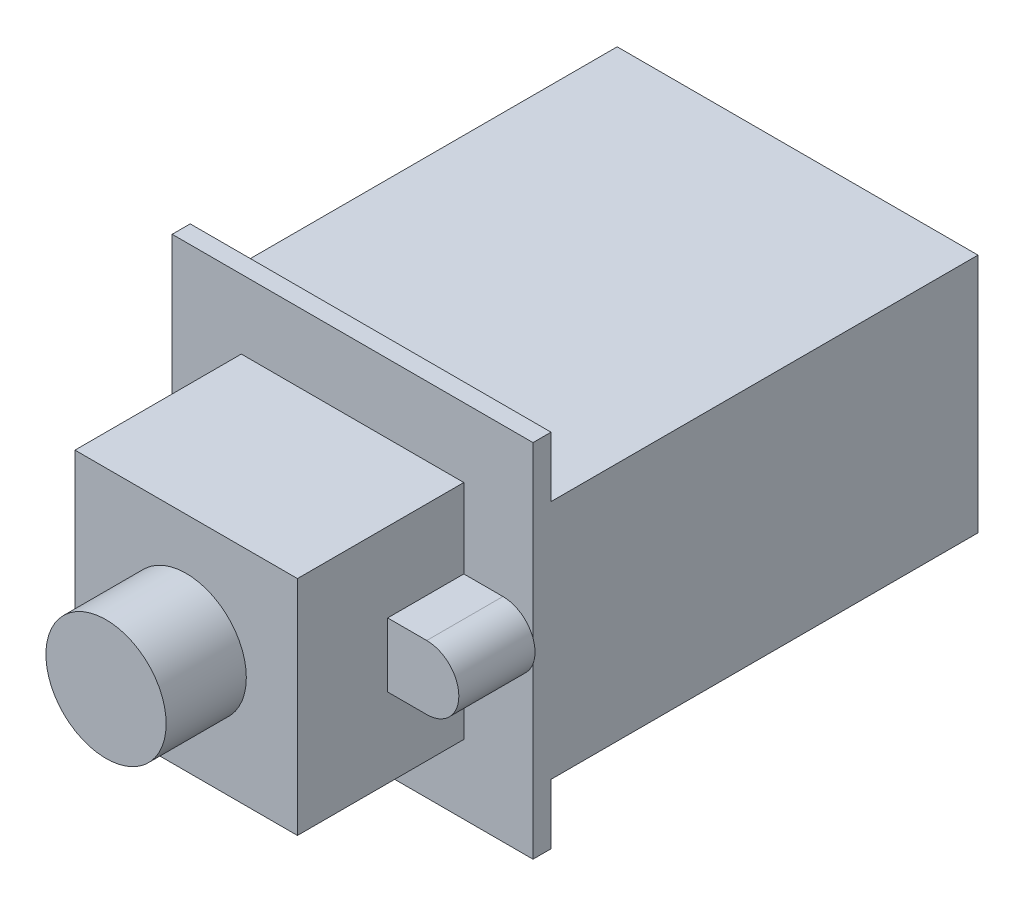
ISO-10303-21;
HEADER;
FILE_DESCRIPTION(('STEP AP214'),'2;1');
FILE_NAME('part.step','',(''),(''),'','','');
FILE_SCHEMA(('AUTOMOTIVE_DESIGN { 1 0 10303 214 1 1 1 1 }'));
ENDSEC;
DATA;
#1=APPLICATION_CONTEXT('core data for automotive mechanical design processes');
#2=APPLICATION_PROTOCOL_DEFINITION('international standard','automotive_design',2000,#1);
#3=PRODUCT_CONTEXT('',#1,'mechanical');
#4=PRODUCT('Part','Part','',(#3));
#5=PRODUCT_RELATED_PRODUCT_CATEGORY('part','',(#4));
#6=PRODUCT_DEFINITION_FORMATION('','',#4);
#7=PRODUCT_DEFINITION_CONTEXT('part definition',#1,'design');
#8=PRODUCT_DEFINITION('design','',#6,#7);
#9=PRODUCT_DEFINITION_SHAPE('','',#8);
#10=(LENGTH_UNIT() NAMED_UNIT(*) SI_UNIT(.MILLI.,.METRE.));
#11=(NAMED_UNIT(*) PLANE_ANGLE_UNIT() SI_UNIT($,.RADIAN.));
#12=(NAMED_UNIT(*) SI_UNIT($,.STERADIAN.) SOLID_ANGLE_UNIT());
#13=UNCERTAINTY_MEASURE_WITH_UNIT(LENGTH_MEASURE(1.E-05),#10,'distance_accuracy_value','');
#14=(GEOMETRIC_REPRESENTATION_CONTEXT(3) GLOBAL_UNCERTAINTY_ASSIGNED_CONTEXT((#13)) GLOBAL_UNIT_ASSIGNED_CONTEXT((#10,
#11,#12)) REPRESENTATION_CONTEXT('',''));
#15=CARTESIAN_POINT('',(0.,0.,0.));
#16=DIRECTION('',(0.,0.,1.));
#17=DIRECTION('',(1.,0.,0.));
#18=AXIS2_PLACEMENT_3D('',#15,#16,#17);
#19=CARTESIAN_POINT('',(0.,0.,-1.143));
#20=DIRECTION('',(0.,0.,1.));
#21=DIRECTION('',(1.,0.,0.));
#22=AXIS2_PLACEMENT_3D('',#19,#20,#21);
#23=PLANE('',#22);
#24=DIRECTION('',(-1.,0.,0.));
#25=VECTOR('',#24,1.);
#26=CARTESIAN_POINT('',(11.43,-7.62,-1.143));
#27=LINE('',#26,#25);
#28=CARTESIAN_POINT('',(11.43,-7.62,-1.143));
#29=VERTEX_POINT('',#28);
#30=CARTESIAN_POINT('',(-11.43,-7.62,-1.143));
#31=VERTEX_POINT('',#30);
#32=EDGE_CURVE('E54',#29,#31,#27,.T.);
#33=ORIENTED_EDGE('',*,*,#32,.F.);
#34=DIRECTION('',(0.,-1.,0.));
#35=VECTOR('',#34,1.);
#36=CARTESIAN_POINT('',(11.43,-11.43,-1.143));
#37=LINE('',#36,#35);
#38=CARTESIAN_POINT('',(11.43,-11.43,-1.143));
#39=VERTEX_POINT('',#38);
#40=EDGE_CURVE('E221',#29,#39,#37,.T.);
#41=ORIENTED_EDGE('',*,*,#40,.T.);
#42=DIRECTION('',(-1.,0.,0.));
#43=VECTOR('',#42,1.);
#44=CARTESIAN_POINT('',(11.43,-11.43,-1.143));
#45=LINE('',#44,#43);
#46=CARTESIAN_POINT('',(-11.43,-11.43,-1.143));
#47=VERTEX_POINT('',#46);
#48=EDGE_CURVE('E224',#39,#47,#45,.T.);
#49=ORIENTED_EDGE('',*,*,#48,.T.);
#50=DIRECTION('',(0.,1.,0.));
#51=VECTOR('',#50,1.);
#52=CARTESIAN_POINT('',(-11.43,-11.43,-1.143));
#53=LINE('',#52,#51);
#54=EDGE_CURVE('E217',#47,#31,#53,.T.);
#55=ORIENTED_EDGE('',*,*,#54,.T.);
#56=EDGE_LOOP('',(#33,#41,#49,#55));
#57=FACE_BOUND('',#56,.T.);
#58=ADVANCED_FACE('F35',(#57),#23,.F.);
#59=DIRECTION('',(1.,0.,0.));
#60=VECTOR('',#59,1.);
#61=CARTESIAN_POINT('',(11.43,7.62,-1.143));
#62=LINE('',#61,#60);
#63=CARTESIAN_POINT('',(-11.43,7.62,-1.143));
#64=VERTEX_POINT('',#63);
#65=CARTESIAN_POINT('',(11.43,7.62,-1.143));
#66=VERTEX_POINT('',#65);
#67=EDGE_CURVE('E62',#64,#66,#62,.T.);
#68=ORIENTED_EDGE('',*,*,#67,.F.);
#69=CARTESIAN_POINT('',(-11.43,11.43,-1.143));
#70=VERTEX_POINT('',#69);
#71=EDGE_CURVE('E211',#64,#70,#53,.T.);
#72=ORIENTED_EDGE('',*,*,#71,.T.);
#73=DIRECTION('',(1.,0.,0.));
#74=VECTOR('',#73,1.);
#75=CARTESIAN_POINT('',(11.43,11.43,-1.143));
#76=LINE('',#75,#74);
#77=CARTESIAN_POINT('',(11.43,11.43,-1.143));
#78=VERTEX_POINT('',#77);
#79=EDGE_CURVE('E219',#70,#78,#76,.T.);
#80=ORIENTED_EDGE('',*,*,#79,.T.);
#81=EDGE_CURVE('E222',#78,#66,#37,.T.);
#82=ORIENTED_EDGE('',*,*,#81,.T.);
#83=EDGE_LOOP('',(#68,#72,#80,#82));
#84=FACE_BOUND('',#83,.T.);
#85=ADVANCED_FACE('F402',(#84),#23,.F.);
#86=CARTESIAN_POINT('',(0.,0.,0.));
#87=DIRECTION('',(0.,0.,-1.));
#88=DIRECTION('',(-1.,0.,0.));
#89=AXIS2_PLACEMENT_3D('',#86,#87,#88);
#90=PLANE('',#89);
#91=DIRECTION('',(0.,1.,0.));
#92=VECTOR('',#91,1.);
#93=CARTESIAN_POINT('',(-11.43,-11.43,0.));
#94=LINE('',#93,#92);
#95=CARTESIAN_POINT('',(-11.43,-0.707106074079417,0.));
#96=VERTEX_POINT('',#95);
#97=CARTESIAN_POINT('',(-11.43,0.707106074079415,0.));
#98=VERTEX_POINT('',#97);
#99=EDGE_CURVE('E11',#96,#98,#94,.T.);
#100=ORIENTED_EDGE('',*,*,#99,.F.);
#101=CARTESIAN_POINT('',(-9.525,0.,0.));
#102=DIRECTION('',(0.,0.,1.));
#103=DIRECTION('',(1.,0.,0.));
#104=AXIS2_PLACEMENT_3D('',#101,#102,#103);
#105=CIRCLE('',#104,2.032);
#106=EDGE_CURVE('E262',#98,#96,#105,.T.);
#107=ORIENTED_EDGE('',*,*,#106,.F.);
#108=EDGE_LOOP('',(#100,#107));
#109=FACE_BOUND('',#108,.T.);
#110=ADVANCED_FACE('F397',(#109),#90,.T.);
#111=CARTESIAN_POINT('',(-7.0485,-7.0485,10.541));
#112=DIRECTION('',(1.,0.,0.));
#113=DIRECTION('',(0.,0.,-1.));
#114=AXIS2_PLACEMENT_3D('',#111,#112,#113);
#115=PLANE('',#114);
#116=DIRECTION('',(0.,0.,-1.));
#117=VECTOR('',#116,1.);
#118=CARTESIAN_POINT('',(-7.0485,2.032,4.826));
#119=LINE('',#118,#117);
#120=CARTESIAN_POINT('',(-7.0485,2.032,4.826));
#121=VERTEX_POINT('',#120);
#122=CARTESIAN_POINT('',(-7.0485,2.032,0.));
#123=VERTEX_POINT('',#122);
#124=EDGE_CURVE('E272',#121,#123,#119,.T.);
#125=ORIENTED_EDGE('',*,*,#124,.F.);
#126=DIRECTION('',(0.,1.,0.));
#127=VECTOR('',#126,1.);
#128=CARTESIAN_POINT('',(-7.0485,2.032,4.826));
#129=LINE('',#128,#127);
#130=CARTESIAN_POINT('',(-7.0485,-2.032,4.826));
#131=VERTEX_POINT('',#130);
#132=EDGE_CURVE('E253',#131,#121,#129,.T.);
#133=ORIENTED_EDGE('',*,*,#132,.F.);
#134=DIRECTION('',(0.,0.,-1.));
#135=VECTOR('',#134,1.);
#136=CARTESIAN_POINT('',(-7.0485,-2.032,4.826));
#137=LINE('',#136,#135);
#138=CARTESIAN_POINT('',(-7.0485,-2.032,0.));
#139=VERTEX_POINT('',#138);
#140=EDGE_CURVE('E269',#131,#139,#137,.T.);
#141=ORIENTED_EDGE('',*,*,#140,.T.);
#142=DIRECTION('',(0.,-1.,0.));
#143=VECTOR('',#142,1.);
#144=CARTESIAN_POINT('',(-7.0485,-7.0485,0.));
#145=LINE('',#144,#143);
#146=CARTESIAN_POINT('',(-7.0485,-7.0485,0.));
#147=VERTEX_POINT('',#146);
#148=EDGE_CURVE('E330',#139,#147,#145,.T.);
#149=ORIENTED_EDGE('',*,*,#148,.T.);
#150=DIRECTION('',(0.,0.,-1.));
#151=VECTOR('',#150,1.);
#152=CARTESIAN_POINT('',(-7.0485,-7.0485,10.541));
#153=LINE('',#152,#151);
#154=CARTESIAN_POINT('',(-7.0485,-7.0485,10.541));
#155=VERTEX_POINT('',#154);
#156=EDGE_CURVE('E337',#155,#147,#153,.T.);
#157=ORIENTED_EDGE('',*,*,#156,.F.);
#158=DIRECTION('',(0.,-1.,0.));
#159=VECTOR('',#158,1.);
#160=CARTESIAN_POINT('',(-7.0485,-7.0485,10.541));
#161=LINE('',#160,#159);
#162=CARTESIAN_POINT('',(-7.0485,7.0485,10.541));
#163=VERTEX_POINT('',#162);
#164=EDGE_CURVE('E320',#163,#155,#161,.T.);
#165=ORIENTED_EDGE('',*,*,#164,.F.);
#166=DIRECTION('',(0.,0.,-1.));
#167=VECTOR('',#166,1.);
#168=CARTESIAN_POINT('',(-7.0485,7.0485,10.541));
#169=LINE('',#168,#167);
#170=CARTESIAN_POINT('',(-7.0485,7.0485,0.));
#171=VERTEX_POINT('',#170);
#172=EDGE_CURVE('E339',#163,#171,#169,.T.);
#173=ORIENTED_EDGE('',*,*,#172,.T.);
#174=EDGE_CURVE('E331',#171,#123,#145,.T.);
#175=ORIENTED_EDGE('',*,*,#174,.T.);
#176=EDGE_LOOP('',(#125,#133,#141,#149,#157,#165,#173,#175));
#177=FACE_BOUND('',#176,.T.);
#178=ADVANCED_FACE('F358',(#177),#115,.F.);
#179=CARTESIAN_POINT('',(7.0485,-7.0485,10.541));
#180=DIRECTION('',(-1.,0.,0.));
#181=DIRECTION('',(0.,0.,1.));
#182=AXIS2_PLACEMENT_3D('',#179,#180,#181);
#183=PLANE('',#182);
#184=DIRECTION('',(0.,0.,-1.));
#185=VECTOR('',#184,1.);
#186=CARTESIAN_POINT('',(7.0485,-2.032,4.826));
#187=LINE('',#186,#185);
#188=CARTESIAN_POINT('',(7.0485,-2.032,4.826));
#189=VERTEX_POINT('',#188);
#190=CARTESIAN_POINT('',(7.0485,-2.032,0.));
#191=VERTEX_POINT('',#190);
#192=EDGE_CURVE('E305',#189,#191,#187,.T.);
#193=ORIENTED_EDGE('',*,*,#192,.F.);
#194=DIRECTION('',(0.,1.,0.));
#195=VECTOR('',#194,1.);
#196=CARTESIAN_POINT('',(7.0485,2.032,4.826));
#197=LINE('',#196,#195);
#198=CARTESIAN_POINT('',(7.0485,2.032,4.826));
#199=VERTEX_POINT('',#198);
#200=EDGE_CURVE('E283',#189,#199,#197,.T.);
#201=ORIENTED_EDGE('',*,*,#200,.T.);
#202=DIRECTION('',(0.,0.,-1.));
#203=VECTOR('',#202,1.);
#204=CARTESIAN_POINT('',(7.0485,2.032,4.826));
#205=LINE('',#204,#203);
#206=CARTESIAN_POINT('',(7.0485,2.032,0.));
#207=VERTEX_POINT('',#206);
#208=EDGE_CURVE('E302',#199,#207,#205,.T.);
#209=ORIENTED_EDGE('',*,*,#208,.T.);
#210=DIRECTION('',(0.,1.,0.));
#211=VECTOR('',#210,1.);
#212=CARTESIAN_POINT('',(7.0485,-7.0485,0.));
#213=LINE('',#212,#211);
#214=CARTESIAN_POINT('',(7.0485,7.0485,0.));
#215=VERTEX_POINT('',#214);
#216=EDGE_CURVE('E310',#207,#215,#213,.T.);
#217=ORIENTED_EDGE('',*,*,#216,.T.);
#218=DIRECTION('',(0.,0.,-1.));
#219=VECTOR('',#218,1.);
#220=CARTESIAN_POINT('',(7.0485,7.0485,10.541));
#221=LINE('',#220,#219);
#222=CARTESIAN_POINT('',(7.0485,7.0485,10.541));
#223=VERTEX_POINT('',#222);
#224=EDGE_CURVE('E39',#223,#215,#221,.T.);
#225=ORIENTED_EDGE('',*,*,#224,.F.);
#226=DIRECTION('',(0.,1.,0.));
#227=VECTOR('',#226,1.);
#228=CARTESIAN_POINT('',(7.0485,-7.0485,10.541));
#229=LINE('',#228,#227);
#230=CARTESIAN_POINT('',(7.0485,-7.0485,10.541));
#231=VERTEX_POINT('',#230);
#232=EDGE_CURVE('E314',#231,#223,#229,.T.);
#233=ORIENTED_EDGE('',*,*,#232,.F.);
#234=DIRECTION('',(0.,0.,-1.));
#235=VECTOR('',#234,1.);
#236=CARTESIAN_POINT('',(7.0485,-7.0485,10.541));
#237=LINE('',#236,#235);
#238=CARTESIAN_POINT('',(7.0485,-7.0485,0.));
#239=VERTEX_POINT('',#238);
#240=EDGE_CURVE('E324',#231,#239,#237,.T.);
#241=ORIENTED_EDGE('',*,*,#240,.T.);
#242=EDGE_CURVE('E325',#239,#191,#213,.T.);
#243=ORIENTED_EDGE('',*,*,#242,.T.);
#244=EDGE_LOOP('',(#193,#201,#209,#217,#225,#233,#241,#243));
#245=FACE_BOUND('',#244,.T.);
#246=ADVANCED_FACE('F37',(#245),#183,.F.);
#247=CARTESIAN_POINT('',(-7.0485,7.0485,10.541));
#248=DIRECTION('',(0.,-1.,0.));
#249=DIRECTION('',(0.,0.,-1.));
#250=AXIS2_PLACEMENT_3D('',#247,#248,#249);
#251=PLANE('',#250);
#252=DIRECTION('',(-1.,0.,0.));
#253=VECTOR('',#252,1.);
#254=CARTESIAN_POINT('',(-7.0485,7.0485,0.));
#255=LINE('',#254,#253);
#256=EDGE_CURVE('E328',#215,#171,#255,.T.);
#257=ORIENTED_EDGE('',*,*,#256,.T.);
#258=ORIENTED_EDGE('',*,*,#172,.F.);
#259=DIRECTION('',(-1.,0.,0.));
#260=VECTOR('',#259,1.);
#261=CARTESIAN_POINT('',(-7.0485,7.0485,10.541));
#262=LINE('',#261,#260);
#263=EDGE_CURVE('E317',#223,#163,#262,.T.);
#264=ORIENTED_EDGE('',*,*,#263,.F.);
#265=ORIENTED_EDGE('',*,*,#224,.T.);
#266=EDGE_LOOP('',(#257,#258,#264,#265));
#267=FACE_BOUND('',#266,.T.);
#268=ADVANCED_FACE('F349',(#267),#251,.F.);
#269=CARTESIAN_POINT('',(-7.0485,-7.0485,10.541));
#270=DIRECTION('',(0.,1.,0.));
#271=DIRECTION('',(0.,0.,1.));
#272=AXIS2_PLACEMENT_3D('',#269,#270,#271);
#273=PLANE('',#272);
#274=DIRECTION('',(1.,0.,0.));
#275=VECTOR('',#274,1.);
#276=CARTESIAN_POINT('',(-7.0485,-7.0485,0.));
#277=LINE('',#276,#275);
#278=EDGE_CURVE('E318',#147,#239,#277,.T.);
#279=ORIENTED_EDGE('',*,*,#278,.T.);
#280=ORIENTED_EDGE('',*,*,#240,.F.);
#281=DIRECTION('',(1.,0.,0.));
#282=VECTOR('',#281,1.);
#283=CARTESIAN_POINT('',(-7.0485,-7.0485,10.541));
#284=LINE('',#283,#282);
#285=EDGE_CURVE('E322',#155,#231,#284,.T.);
#286=ORIENTED_EDGE('',*,*,#285,.F.);
#287=ORIENTED_EDGE('',*,*,#156,.T.);
#288=EDGE_LOOP('',(#279,#280,#286,#287));
#289=FACE_BOUND('',#288,.T.);
#290=ADVANCED_FACE('F381',(#289),#273,.F.);
#291=CARTESIAN_POINT('',(0.,0.,10.541));
#292=DIRECTION('',(0.,0.,-1.));
#293=DIRECTION('',(-1.,0.,0.));
#294=AXIS2_PLACEMENT_3D('',#291,#292,#293);
#295=PLANE('',#294);
#296=CARTESIAN_POINT('',(0.,0.,10.541));
#297=DIRECTION('',(0.,0.,1.));
#298=DIRECTION('',(1.,0.,0.));
#299=AXIS2_PLACEMENT_3D('',#296,#297,#298);
#300=CIRCLE('',#299,3.81);
#301=CARTESIAN_POINT('',(3.81,0.,10.541));
#302=VERTEX_POINT('',#301);
#303=EDGE_CURVE('E311',#302,#302,#300,.T.);
#304=ORIENTED_EDGE('',*,*,#303,.F.);
#305=EDGE_LOOP('',(#304));
#306=FACE_BOUND('',#305,.T.);
#307=ORIENTED_EDGE('',*,*,#232,.T.);
#308=ORIENTED_EDGE('',*,*,#263,.T.);
#309=ORIENTED_EDGE('',*,*,#164,.T.);
#310=ORIENTED_EDGE('',*,*,#285,.T.);
#311=EDGE_LOOP('',(#307,#308,#309,#310));
#312=FACE_BOUND('',#311,.T.);
#313=ADVANCED_FACE('F385',(#306,#312),#295,.F.);
#314=DIRECTION('',(0.,-1.,0.));
#315=VECTOR('',#314,1.);
#316=CARTESIAN_POINT('',(11.43,-11.43,0.));
#317=LINE('',#316,#315);
#318=CARTESIAN_POINT('',(11.43,0.707106074079405,0.));
#319=VERTEX_POINT('',#318);
#320=CARTESIAN_POINT('',(11.43,-0.707106074079408,0.));
#321=VERTEX_POINT('',#320);
#322=EDGE_CURVE('E44',#319,#321,#317,.T.);
#323=ORIENTED_EDGE('',*,*,#322,.F.);
#324=CARTESIAN_POINT('',(9.525,0.,0.));
#325=DIRECTION('',(0.,0.,-1.));
#326=DIRECTION('',(-1.,0.,0.));
#327=AXIS2_PLACEMENT_3D('',#324,#325,#326);
#328=CIRCLE('',#327,2.032);
#329=EDGE_CURVE('E294',#319,#321,#328,.T.);
#330=ORIENTED_EDGE('',*,*,#329,.T.);
#331=EDGE_LOOP('',(#323,#330));
#332=FACE_BOUND('',#331,.T.);
#333=ADVANCED_FACE('F387',(#332),#90,.T.);
#334=CARTESIAN_POINT('',(0.,0.,15.621));
#335=DIRECTION('',(0.,0.,-1.));
#336=DIRECTION('',(-1.,0.,0.));
#337=AXIS2_PLACEMENT_3D('',#334,#335,#336);
#338=CYLINDRICAL_SURFACE('',#337,3.81);
#339=CARTESIAN_POINT('',(0.,0.,15.621));
#340=DIRECTION('',(0.,0.,1.));
#341=DIRECTION('',(1.,0.,0.));
#342=AXIS2_PLACEMENT_3D('',#339,#340,#341);
#343=CIRCLE('',#342,3.81);
#344=CARTESIAN_POINT('',(3.81,0.,15.621));
#345=VERTEX_POINT('',#344);
#346=EDGE_CURVE('E301',#345,#345,#343,.T.);
#347=ORIENTED_EDGE('',*,*,#346,.F.);
#348=EDGE_LOOP('',(#347));
#349=FACE_BOUND('',#348,.T.);
#350=ORIENTED_EDGE('',*,*,#303,.T.);
#351=EDGE_LOOP('',(#350));
#352=FACE_BOUND('',#351,.T.);
#353=ADVANCED_FACE('F394',(#349,#352),#338,.T.);
#354=CARTESIAN_POINT('',(0.,0.,15.621));
#355=DIRECTION('',(0.,0.,1.));
#356=DIRECTION('',(1.,0.,0.));
#357=AXIS2_PLACEMENT_3D('',#354,#355,#356);
#358=PLANE('',#357);
#359=ORIENTED_EDGE('',*,*,#346,.T.);
#360=EDGE_LOOP('',(#359));
#361=FACE_BOUND('',#360,.T.);
#362=ADVANCED_FACE('F451',(#361),#358,.T.);
#363=CARTESIAN_POINT('',(9.525,0.,4.826));
#364=DIRECTION('',(0.,0.,-1.));
#365=DIRECTION('',(-1.,0.,0.));
#366=AXIS2_PLACEMENT_3D('',#363,#364,#365);
#367=CYLINDRICAL_SURFACE('',#366,2.032);
#368=CARTESIAN_POINT('',(9.525,2.032,0.));
#369=VERTEX_POINT('',#368);
#370=EDGE_CURVE('E290',#369,#319,#328,.T.);
#371=ORIENTED_EDGE('',*,*,#370,.F.);
#372=DIRECTION('',(0.,0.,-1.));
#373=VECTOR('',#372,1.);
#374=CARTESIAN_POINT('',(9.525,2.032,4.826));
#375=LINE('',#374,#373);
#376=CARTESIAN_POINT('',(9.525,2.032,4.826));
#377=VERTEX_POINT('',#376);
#378=EDGE_CURVE('E299',#377,#369,#375,.T.);
#379=ORIENTED_EDGE('',*,*,#378,.F.);
#380=CARTESIAN_POINT('',(9.525,0.,4.826));
#381=DIRECTION('',(0.,0.,-1.));
#382=DIRECTION('',(-1.,0.,0.));
#383=AXIS2_PLACEMENT_3D('',#380,#381,#382);
#384=CIRCLE('',#383,2.032);
#385=CARTESIAN_POINT('',(9.525,-2.032,4.826));
#386=VERTEX_POINT('',#385);
#387=EDGE_CURVE('E276',#377,#386,#384,.T.);
#388=ORIENTED_EDGE('',*,*,#387,.T.);
#389=DIRECTION('',(0.,0.,-1.));
#390=VECTOR('',#389,1.);
#391=CARTESIAN_POINT('',(9.525,-2.032,4.826));
#392=LINE('',#391,#390);
#393=CARTESIAN_POINT('',(9.525,-2.032,0.));
#394=VERTEX_POINT('',#393);
#395=EDGE_CURVE('E289',#386,#394,#392,.T.);
#396=ORIENTED_EDGE('',*,*,#395,.T.);
#397=EDGE_CURVE('E268',#321,#394,#328,.T.);
#398=ORIENTED_EDGE('',*,*,#397,.F.);
#399=ORIENTED_EDGE('',*,*,#329,.F.);
#400=EDGE_LOOP('',(#371,#379,#388,#396,#398,#399));
#401=FACE_BOUND('',#400,.T.);
#402=ADVANCED_FACE('F444',(#401),#367,.T.);
#403=CARTESIAN_POINT('',(9.525,2.032,4.826));
#404=DIRECTION('',(0.,1.,0.));
#405=DIRECTION('',(0.,0.,1.));
#406=AXIS2_PLACEMENT_3D('',#403,#404,#405);
#407=PLANE('',#406);
#408=DIRECTION('',(1.,0.,0.));
#409=VECTOR('',#408,1.);
#410=CARTESIAN_POINT('',(9.525,2.032,0.));
#411=LINE('',#410,#409);
#412=EDGE_CURVE('E280',#207,#369,#411,.T.);
#413=ORIENTED_EDGE('',*,*,#412,.F.);
#414=ORIENTED_EDGE('',*,*,#208,.F.);
#415=DIRECTION('',(1.,0.,0.));
#416=VECTOR('',#415,1.);
#417=CARTESIAN_POINT('',(9.525,2.032,4.826));
#418=LINE('',#417,#416);
#419=EDGE_CURVE('E286',#199,#377,#418,.T.);
#420=ORIENTED_EDGE('',*,*,#419,.T.);
#421=ORIENTED_EDGE('',*,*,#378,.T.);
#422=EDGE_LOOP('',(#413,#414,#420,#421));
#423=FACE_BOUND('',#422,.T.);
#424=ADVANCED_FACE('F441',(#423),#407,.T.);
#425=CARTESIAN_POINT('',(7.0485,-2.032,4.826));
#426=DIRECTION('',(0.,-1.,0.));
#427=DIRECTION('',(0.,0.,-1.));
#428=AXIS2_PLACEMENT_3D('',#425,#426,#427);
#429=PLANE('',#428);
#430=DIRECTION('',(-1.,0.,0.));
#431=VECTOR('',#430,1.);
#432=CARTESIAN_POINT('',(7.0485,-2.032,0.));
#433=LINE('',#432,#431);
#434=EDGE_CURVE('E293',#394,#191,#433,.T.);
#435=ORIENTED_EDGE('',*,*,#434,.F.);
#436=ORIENTED_EDGE('',*,*,#395,.F.);
#437=DIRECTION('',(-1.,0.,0.));
#438=VECTOR('',#437,1.);
#439=CARTESIAN_POINT('',(7.0485,-2.032,4.826));
#440=LINE('',#439,#438);
#441=EDGE_CURVE('E279',#386,#189,#440,.T.);
#442=ORIENTED_EDGE('',*,*,#441,.T.);
#443=ORIENTED_EDGE('',*,*,#192,.T.);
#444=EDGE_LOOP('',(#435,#436,#442,#443));
#445=FACE_BOUND('',#444,.T.);
#446=ADVANCED_FACE('F439',(#445),#429,.T.);
#447=CARTESIAN_POINT('',(9.525,0.,4.826));
#448=DIRECTION('',(0.,0.,-1.));
#449=DIRECTION('',(-1.,0.,0.));
#450=AXIS2_PLACEMENT_3D('',#447,#448,#449);
#451=PLANE('',#450);
#452=ORIENTED_EDGE('',*,*,#387,.F.);
#453=ORIENTED_EDGE('',*,*,#419,.F.);
#454=ORIENTED_EDGE('',*,*,#200,.F.);
#455=ORIENTED_EDGE('',*,*,#441,.F.);
#456=EDGE_LOOP('',(#452,#453,#454,#455));
#457=FACE_BOUND('',#456,.T.);
#458=ADVANCED_FACE('F435',(#457),#451,.F.);
#459=CARTESIAN_POINT('',(-9.525,0.,4.826));
#460=DIRECTION('',(0.,0.,-1.));
#461=DIRECTION('',(-1.,0.,0.));
#462=AXIS2_PLACEMENT_3D('',#459,#460,#461);
#463=CYLINDRICAL_SURFACE('',#462,2.032);
#464=CARTESIAN_POINT('',(-9.525,2.032,0.));
#465=VERTEX_POINT('',#464);
#466=EDGE_CURVE('E258',#465,#98,#105,.T.);
#467=ORIENTED_EDGE('',*,*,#466,.T.);
#468=ORIENTED_EDGE('',*,*,#106,.T.);
#469=CARTESIAN_POINT('',(-9.525,-2.032,0.));
#470=VERTEX_POINT('',#469);
#471=EDGE_CURVE('E246',#96,#470,#105,.T.);
#472=ORIENTED_EDGE('',*,*,#471,.T.);
#473=DIRECTION('',(0.,0.,-1.));
#474=VECTOR('',#473,1.);
#475=CARTESIAN_POINT('',(-9.525,-2.032,4.826));
#476=LINE('',#475,#474);
#477=CARTESIAN_POINT('',(-9.525,-2.032,4.826));
#478=VERTEX_POINT('',#477);
#479=EDGE_CURVE('E265',#478,#470,#476,.T.);
#480=ORIENTED_EDGE('',*,*,#479,.F.);
#481=CARTESIAN_POINT('',(-9.525,0.,4.826));
#482=DIRECTION('',(0.,0.,1.));
#483=DIRECTION('',(1.,0.,0.));
#484=AXIS2_PLACEMENT_3D('',#481,#482,#483);
#485=CIRCLE('',#484,2.032);
#486=CARTESIAN_POINT('',(-9.525,2.032,4.826));
#487=VERTEX_POINT('',#486);
#488=EDGE_CURVE('E247',#487,#478,#485,.T.);
#489=ORIENTED_EDGE('',*,*,#488,.F.);
#490=DIRECTION('',(0.,0.,-1.));
#491=VECTOR('',#490,1.);
#492=CARTESIAN_POINT('',(-9.525,2.032,4.826));
#493=LINE('',#492,#491);
#494=EDGE_CURVE('E257',#487,#465,#493,.T.);
#495=ORIENTED_EDGE('',*,*,#494,.T.);
#496=EDGE_LOOP('',(#467,#468,#472,#480,#489,#495));
#497=FACE_BOUND('',#496,.T.);
#498=ADVANCED_FACE('F430',(#497),#463,.T.);
#499=CARTESIAN_POINT('',(-7.0485,-2.032,4.826));
#500=DIRECTION('',(0.,1.,0.));
#501=DIRECTION('',(0.,0.,1.));
#502=AXIS2_PLACEMENT_3D('',#499,#500,#501);
#503=PLANE('',#502);
#504=DIRECTION('',(1.,0.,0.));
#505=VECTOR('',#504,1.);
#506=CARTESIAN_POINT('',(-7.0485,-2.032,0.));
#507=LINE('',#506,#505);
#508=EDGE_CURVE('E251',#470,#139,#507,.T.);
#509=ORIENTED_EDGE('',*,*,#508,.T.);
#510=ORIENTED_EDGE('',*,*,#140,.F.);
#511=DIRECTION('',(1.,0.,0.));
#512=VECTOR('',#511,1.);
#513=CARTESIAN_POINT('',(-7.0485,-2.032,4.826));
#514=LINE('',#513,#512);
#515=EDGE_CURVE('E255',#478,#131,#514,.T.);
#516=ORIENTED_EDGE('',*,*,#515,.F.);
#517=ORIENTED_EDGE('',*,*,#479,.T.);
#518=EDGE_LOOP('',(#509,#510,#516,#517));
#519=FACE_BOUND('',#518,.T.);
#520=ADVANCED_FACE('F370',(#519),#503,.F.);
#521=CARTESIAN_POINT('',(-9.525,2.032,4.826));
#522=DIRECTION('',(0.,-1.,0.));
#523=DIRECTION('',(0.,0.,-1.));
#524=AXIS2_PLACEMENT_3D('',#521,#522,#523);
#525=PLANE('',#524);
#526=DIRECTION('',(-1.,0.,0.));
#527=VECTOR('',#526,1.);
#528=CARTESIAN_POINT('',(-9.525,2.032,0.));
#529=LINE('',#528,#527);
#530=EDGE_CURVE('E261',#123,#465,#529,.T.);
#531=ORIENTED_EDGE('',*,*,#530,.T.);
#532=ORIENTED_EDGE('',*,*,#494,.F.);
#533=DIRECTION('',(-1.,0.,0.));
#534=VECTOR('',#533,1.);
#535=CARTESIAN_POINT('',(-9.525,2.032,4.826));
#536=LINE('',#535,#534);
#537=EDGE_CURVE('E250',#121,#487,#536,.T.);
#538=ORIENTED_EDGE('',*,*,#537,.F.);
#539=ORIENTED_EDGE('',*,*,#124,.T.);
#540=EDGE_LOOP('',(#531,#532,#538,#539));
#541=FACE_BOUND('',#540,.T.);
#542=ADVANCED_FACE('F362',(#541),#525,.F.);
#543=CARTESIAN_POINT('',(-9.525,0.,4.826));
#544=DIRECTION('',(0.,0.,-1.));
#545=DIRECTION('',(1.,0.,0.));
#546=AXIS2_PLACEMENT_3D('',#543,#544,#545);
#547=PLANE('',#546);
#548=ORIENTED_EDGE('',*,*,#488,.T.);
#549=ORIENTED_EDGE('',*,*,#515,.T.);
#550=ORIENTED_EDGE('',*,*,#132,.T.);
#551=ORIENTED_EDGE('',*,*,#537,.T.);
#552=EDGE_LOOP('',(#548,#549,#550,#551));
#553=FACE_BOUND('',#552,.T.);
#554=ADVANCED_FACE('F366',(#553),#547,.F.);
#555=CARTESIAN_POINT('',(0.,0.,0.));
#556=DIRECTION('',(0.,0.,1.));
#557=DIRECTION('',(1.,0.,0.));
#558=AXIS2_PLACEMENT_3D('',#555,#556,#557);
#559=PLANE('',#558);
#560=ORIENTED_EDGE('',*,*,#466,.F.);
#561=ORIENTED_EDGE('',*,*,#530,.F.);
#562=ORIENTED_EDGE('',*,*,#174,.F.);
#563=ORIENTED_EDGE('',*,*,#256,.F.);
#564=ORIENTED_EDGE('',*,*,#216,.F.);
#565=ORIENTED_EDGE('',*,*,#412,.T.);
#566=ORIENTED_EDGE('',*,*,#370,.T.);
#567=CARTESIAN_POINT('',(11.43,11.43,0.));
#568=VERTEX_POINT('',#567);
#569=EDGE_CURVE('E230',#568,#319,#317,.T.);
#570=ORIENTED_EDGE('',*,*,#569,.F.);
#571=DIRECTION('',(1.,0.,0.));
#572=VECTOR('',#571,1.);
#573=CARTESIAN_POINT('',(11.43,11.43,0.));
#574=LINE('',#573,#572);
#575=CARTESIAN_POINT('',(-11.43,11.43,0.));
#576=VERTEX_POINT('',#575);
#577=EDGE_CURVE('E227',#576,#568,#574,.T.);
#578=ORIENTED_EDGE('',*,*,#577,.F.);
#579=EDGE_CURVE('E47',#98,#576,#94,.T.);
#580=ORIENTED_EDGE('',*,*,#579,.F.);
#581=EDGE_LOOP('',(#560,#561,#562,#563,#564,#565,#566,#570,#578,#580));
#582=FACE_BOUND('',#581,.T.);
#583=ADVANCED_FACE('F355',(#582),#559,.T.);
#584=ORIENTED_EDGE('',*,*,#471,.F.);
#585=CARTESIAN_POINT('',(-11.43,-11.43,0.));
#586=VERTEX_POINT('',#585);
#587=EDGE_CURVE('E46',#586,#96,#94,.T.);
#588=ORIENTED_EDGE('',*,*,#587,.F.);
#589=DIRECTION('',(-1.,0.,0.));
#590=VECTOR('',#589,1.);
#591=CARTESIAN_POINT('',(11.43,-11.43,0.));
#592=LINE('',#591,#590);
#593=CARTESIAN_POINT('',(11.43,-11.43,0.));
#594=VERTEX_POINT('',#593);
#595=EDGE_CURVE('E233',#594,#586,#592,.T.);
#596=ORIENTED_EDGE('',*,*,#595,.F.);
#597=EDGE_CURVE('E229',#321,#594,#317,.T.);
#598=ORIENTED_EDGE('',*,*,#597,.F.);
#599=ORIENTED_EDGE('',*,*,#397,.T.);
#600=ORIENTED_EDGE('',*,*,#434,.T.);
#601=ORIENTED_EDGE('',*,*,#242,.F.);
#602=ORIENTED_EDGE('',*,*,#278,.F.);
#603=ORIENTED_EDGE('',*,*,#148,.F.);
#604=ORIENTED_EDGE('',*,*,#508,.F.);
#605=EDGE_LOOP('',(#584,#588,#596,#598,#599,#600,#601,#602,#603,#604));
#606=FACE_BOUND('',#605,.T.);
#607=ADVANCED_FACE('F377',(#606),#559,.T.);
#608=CARTESIAN_POINT('',(-11.43,-11.43,-1.143));
#609=DIRECTION('',(1.,0.,0.));
#610=DIRECTION('',(0.,0.,-1.));
#611=AXIS2_PLACEMENT_3D('',#608,#609,#610);
#612=PLANE('',#611);
#613=ORIENTED_EDGE('',*,*,#587,.T.);
#614=ORIENTED_EDGE('',*,*,#99,.T.);
#615=ORIENTED_EDGE('',*,*,#579,.T.);
#616=DIRECTION('',(0.,0.,1.));
#617=VECTOR('',#616,1.);
#618=CARTESIAN_POINT('',(-11.43,11.43,-1.143));
#619=LINE('',#618,#617);
#620=EDGE_CURVE('E243',#70,#576,#619,.T.);
#621=ORIENTED_EDGE('',*,*,#620,.F.);
#622=ORIENTED_EDGE('',*,*,#71,.F.);
#623=DIRECTION('',(0.,0.,1.));
#624=VECTOR('',#623,1.);
#625=CARTESIAN_POINT('',(-11.43,7.62,-28.194));
#626=LINE('',#625,#624);
#627=CARTESIAN_POINT('',(-11.43,7.62,-28.194));
#628=VERTEX_POINT('',#627);
#629=EDGE_CURVE('E192',#628,#64,#626,.T.);
#630=ORIENTED_EDGE('',*,*,#629,.F.);
#631=DIRECTION('',(0.,1.,0.));
#632=VECTOR('',#631,1.);
#633=CARTESIAN_POINT('',(-11.43,-7.62,-28.194));
#634=LINE('',#633,#632);
#635=CARTESIAN_POINT('',(-11.43,-7.62,-28.194));
#636=VERTEX_POINT('',#635);
#637=EDGE_CURVE('E198',#636,#628,#634,.T.);
#638=ORIENTED_EDGE('',*,*,#637,.F.);
#639=DIRECTION('',(0.,0.,1.));
#640=VECTOR('',#639,1.);
#641=CARTESIAN_POINT('',(-11.43,-7.62,-28.194));
#642=LINE('',#641,#640);
#643=EDGE_CURVE('E679',#636,#31,#642,.T.);
#644=ORIENTED_EDGE('',*,*,#643,.T.);
#645=ORIENTED_EDGE('',*,*,#54,.F.);
#646=DIRECTION('',(0.,0.,1.));
#647=VECTOR('',#646,1.);
#648=CARTESIAN_POINT('',(-11.43,-11.43,-1.143));
#649=LINE('',#648,#647);
#650=EDGE_CURVE('E225',#47,#586,#649,.T.);
#651=ORIENTED_EDGE('',*,*,#650,.T.);
#652=EDGE_LOOP('',(#613,#614,#615,#621,#622,#630,#638,#644,#645,#651));
#653=FACE_BOUND('',#652,.T.);
#654=ADVANCED_FACE('F209',(#653),#612,.F.);
#655=CARTESIAN_POINT('',(11.43,11.43,-1.143));
#656=DIRECTION('',(0.,-1.,0.));
#657=DIRECTION('',(0.,0.,-1.));
#658=AXIS2_PLACEMENT_3D('',#655,#656,#657);
#659=PLANE('',#658);
#660=ORIENTED_EDGE('',*,*,#577,.T.);
#661=DIRECTION('',(0.,0.,1.));
#662=VECTOR('',#661,1.);
#663=CARTESIAN_POINT('',(11.43,11.43,-1.143));
#664=LINE('',#663,#662);
#665=EDGE_CURVE('E240',#78,#568,#664,.T.);
#666=ORIENTED_EDGE('',*,*,#665,.F.);
#667=ORIENTED_EDGE('',*,*,#79,.F.);
#668=ORIENTED_EDGE('',*,*,#620,.T.);
#669=EDGE_LOOP('',(#660,#666,#667,#668));
#670=FACE_BOUND('',#669,.T.);
#671=ADVANCED_FACE('F419',(#670),#659,.F.);
#672=CARTESIAN_POINT('',(11.43,-11.43,-1.143));
#673=DIRECTION('',(-1.,0.,0.));
#674=DIRECTION('',(0.,0.,1.));
#675=AXIS2_PLACEMENT_3D('',#672,#673,#674);
#676=PLANE('',#675);
#677=ORIENTED_EDGE('',*,*,#569,.T.);
#678=ORIENTED_EDGE('',*,*,#322,.T.);
#679=ORIENTED_EDGE('',*,*,#597,.T.);
#680=DIRECTION('',(0.,0.,1.));
#681=VECTOR('',#680,1.);
#682=CARTESIAN_POINT('',(11.43,-11.43,-1.143));
#683=LINE('',#682,#681);
#684=EDGE_CURVE('E237',#39,#594,#683,.T.);
#685=ORIENTED_EDGE('',*,*,#684,.F.);
#686=ORIENTED_EDGE('',*,*,#40,.F.);
#687=DIRECTION('',(0.,0.,1.));
#688=VECTOR('',#687,1.);
#689=CARTESIAN_POINT('',(11.43,-7.62,-28.194));
#690=LINE('',#689,#688);
#691=CARTESIAN_POINT('',(11.43,-7.62,-28.194));
#692=VERTEX_POINT('',#691);
#693=EDGE_CURVE('E213',#692,#29,#690,.T.);
#694=ORIENTED_EDGE('',*,*,#693,.F.);
#695=DIRECTION('',(0.,-1.,0.));
#696=VECTOR('',#695,1.);
#697=CARTESIAN_POINT('',(11.43,-7.62,-28.194));
#698=LINE('',#697,#696);
#699=CARTESIAN_POINT('',(11.43,7.62,-28.194));
#700=VERTEX_POINT('',#699);
#701=EDGE_CURVE('E197',#700,#692,#698,.T.);
#702=ORIENTED_EDGE('',*,*,#701,.F.);
#703=DIRECTION('',(0.,0.,1.));
#704=VECTOR('',#703,1.);
#705=CARTESIAN_POINT('',(11.43,7.62,-28.194));
#706=LINE('',#705,#704);
#707=EDGE_CURVE('E194',#700,#66,#706,.T.);
#708=ORIENTED_EDGE('',*,*,#707,.T.);
#709=ORIENTED_EDGE('',*,*,#81,.F.);
#710=ORIENTED_EDGE('',*,*,#665,.T.);
#711=EDGE_LOOP('',(#677,#678,#679,#685,#686,#694,#702,#708,#709,#710));
#712=FACE_BOUND('',#711,.T.);
#713=ADVANCED_FACE('F415',(#712),#676,.F.);
#714=CARTESIAN_POINT('',(11.43,-11.43,-1.143));
#715=DIRECTION('',(0.,1.,0.));
#716=DIRECTION('',(0.,0.,1.));
#717=AXIS2_PLACEMENT_3D('',#714,#715,#716);
#718=PLANE('',#717);
#719=ORIENTED_EDGE('',*,*,#595,.T.);
#720=ORIENTED_EDGE('',*,*,#650,.F.);
#721=ORIENTED_EDGE('',*,*,#48,.F.);
#722=ORIENTED_EDGE('',*,*,#684,.T.);
#723=EDGE_LOOP('',(#719,#720,#721,#722));
#724=FACE_BOUND('',#723,.T.);
#725=ADVANCED_FACE('F412',(#724),#718,.F.);
#726=CARTESIAN_POINT('',(11.43,7.62,-28.194));
#727=DIRECTION('',(0.,-1.,0.));
#728=DIRECTION('',(0.,0.,-1.));
#729=AXIS2_PLACEMENT_3D('',#726,#727,#728);
#730=PLANE('',#729);
#731=ORIENTED_EDGE('',*,*,#67,.T.);
#732=ORIENTED_EDGE('',*,*,#707,.F.);
#733=DIRECTION('',(1.,0.,0.));
#734=VECTOR('',#733,1.);
#735=CARTESIAN_POINT('',(11.43,7.62,-28.194));
#736=LINE('',#735,#734);
#737=EDGE_CURVE('E188',#628,#700,#736,.T.);
#738=ORIENTED_EDGE('',*,*,#737,.F.);
#739=ORIENTED_EDGE('',*,*,#629,.T.);
#740=EDGE_LOOP('',(#731,#732,#738,#739));
#741=FACE_BOUND('',#740,.T.);
#742=ADVANCED_FACE('F190',(#741),#730,.F.);
#743=CARTESIAN_POINT('',(11.43,-7.62,-28.194));
#744=DIRECTION('',(0.,1.,0.));
#745=DIRECTION('',(0.,0.,1.));
#746=AXIS2_PLACEMENT_3D('',#743,#744,#745);
#747=PLANE('',#746);
#748=ORIENTED_EDGE('',*,*,#32,.T.);
#749=ORIENTED_EDGE('',*,*,#643,.F.);
#750=DIRECTION('',(-1.,0.,0.));
#751=VECTOR('',#750,1.);
#752=CARTESIAN_POINT('',(11.43,-7.62,-28.194));
#753=LINE('',#752,#751);
#754=EDGE_CURVE('E203',#692,#636,#753,.T.);
#755=ORIENTED_EDGE('',*,*,#754,.F.);
#756=ORIENTED_EDGE('',*,*,#693,.T.);
#757=EDGE_LOOP('',(#748,#749,#755,#756));
#758=FACE_BOUND('',#757,.T.);
#759=ADVANCED_FACE('F532',(#758),#747,.F.);
#760=CARTESIAN_POINT('',(0.,0.,-28.194));
#761=DIRECTION('',(0.,0.,1.));
#762=DIRECTION('',(1.,0.,0.));
#763=AXIS2_PLACEMENT_3D('',#760,#761,#762);
#764=PLANE('',#763);
#765=ORIENTED_EDGE('',*,*,#637,.T.);
#766=ORIENTED_EDGE('',*,*,#737,.T.);
#767=ORIENTED_EDGE('',*,*,#701,.T.);
#768=ORIENTED_EDGE('',*,*,#754,.T.);
#769=EDGE_LOOP('',(#765,#766,#767,#768));
#770=FACE_BOUND('',#769,.T.);
#771=ADVANCED_FACE('F201',(#770),#764,.F.);
#772=CLOSED_SHELL('',(#58,#85,#110,#178,#246,#268,#290,#313,#333,#353,#362,#402,#424,#446,#458,
#498,#520,#542,#554,#583,#607,#654,#671,#713,#725,#742,#759,#771));
#773=MANIFOLD_SOLID_BREP('B2',#772);
#774=ADVANCED_BREP_SHAPE_REPRESENTATION('',(#18,#773),#14);
#775=SHAPE_DEFINITION_REPRESENTATION(#9,#774);
ENDSEC;
END-ISO-10303-21;
